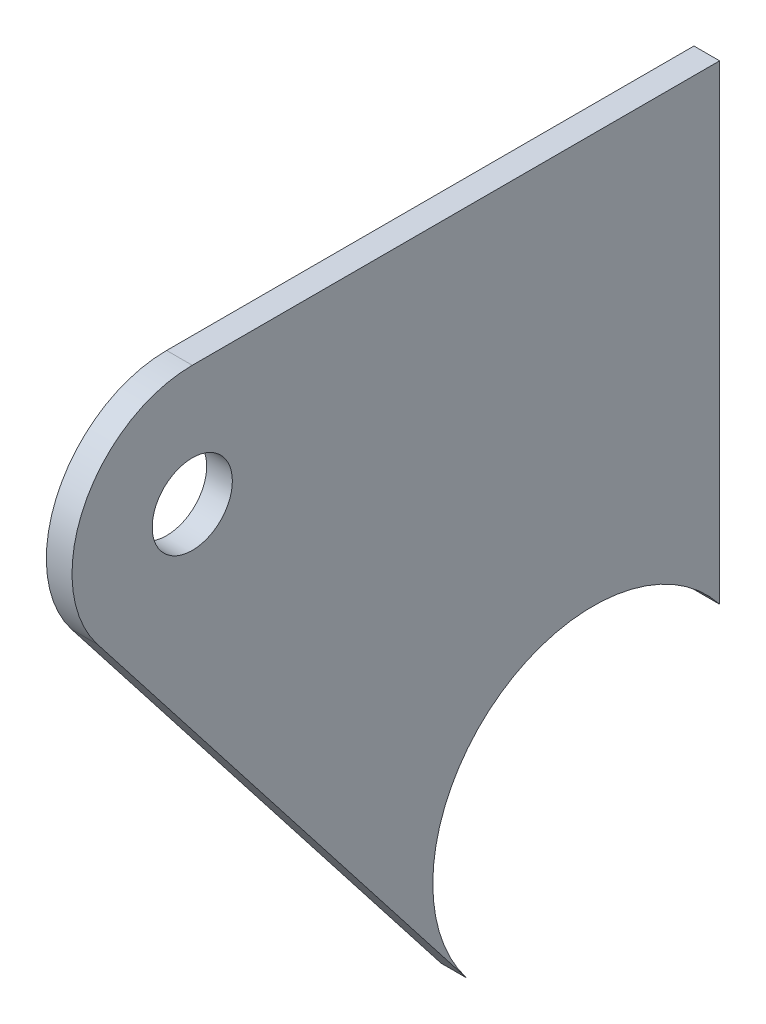
ISO-10303-21;
HEADER;
FILE_DESCRIPTION(('STEP AP214'),'2;1');
FILE_NAME('part.step','',(''),(''),'','','');
FILE_SCHEMA(('AUTOMOTIVE_DESIGN { 1 0 10303 214 1 1 1 1 }'));
ENDSEC;
DATA;
#1=APPLICATION_CONTEXT('core data for automotive mechanical design processes');
#2=APPLICATION_PROTOCOL_DEFINITION('international standard','automotive_design',2000,#1);
#3=PRODUCT_CONTEXT('',#1,'mechanical');
#4=PRODUCT('Part','Part','',(#3));
#5=PRODUCT_RELATED_PRODUCT_CATEGORY('part','',(#4));
#6=PRODUCT_DEFINITION_FORMATION('','',#4);
#7=PRODUCT_DEFINITION_CONTEXT('part definition',#1,'design');
#8=PRODUCT_DEFINITION('design','',#6,#7);
#9=PRODUCT_DEFINITION_SHAPE('','',#8);
#10=(LENGTH_UNIT() NAMED_UNIT(*) SI_UNIT(.MILLI.,.METRE.));
#11=(NAMED_UNIT(*) PLANE_ANGLE_UNIT() SI_UNIT($,.RADIAN.));
#12=(NAMED_UNIT(*) SI_UNIT($,.STERADIAN.) SOLID_ANGLE_UNIT());
#13=UNCERTAINTY_MEASURE_WITH_UNIT(LENGTH_MEASURE(1.E-05),#10,'distance_accuracy_value','');
#14=(GEOMETRIC_REPRESENTATION_CONTEXT(3) GLOBAL_UNCERTAINTY_ASSIGNED_CONTEXT((#13)) GLOBAL_UNIT_ASSIGNED_CONTEXT((#10,
#11,#12)) REPRESENTATION_CONTEXT('',''));
#15=CARTESIAN_POINT('',(0.,0.,0.));
#16=DIRECTION('',(0.,0.,1.));
#17=DIRECTION('',(1.,0.,0.));
#18=AXIS2_PLACEMENT_3D('',#15,#16,#17);
#19=CARTESIAN_POINT('',(14.732,0.,0.));
#20=DIRECTION('',(1.,0.,0.));
#21=DIRECTION('',(0.,0.,-1.));
#22=AXIS2_PLACEMENT_3D('',#19,#20,#21);
#23=PLANE('',#22);
#24=CARTESIAN_POINT('',(14.732,0.,0.));
#25=DIRECTION('',(-1.,0.,0.));
#26=DIRECTION('',(0.,0.,-1.));
#27=AXIS2_PLACEMENT_3D('',#24,#25,#26);
#28=CIRCLE('',#27,12.7);
#29=CARTESIAN_POINT('',(14.732,-7.80867572929975,10.0157168168157));
#30=VERTEX_POINT('',#29);
#31=CARTESIAN_POINT('',(14.732,7.80867572929975,-10.0157168168157));
#32=VERTEX_POINT('',#31);
#33=EDGE_CURVE('E125',#30,#32,#28,.T.);
#34=ORIENTED_EDGE('',*,*,#33,.T.);
#35=DIRECTION('',(0.,1.,0.));
#36=VECTOR('',#35,1.);
#37=CARTESIAN_POINT('',(14.732,45.085,-10.0157168168157));
#38=LINE('',#37,#36);
#39=CARTESIAN_POINT('',(14.732,45.085,-10.0157168168157));
#40=VERTEX_POINT('',#39);
#41=EDGE_CURVE('E92',#32,#40,#38,.T.);
#42=ORIENTED_EDGE('',*,*,#41,.T.);
#43=DIRECTION('',(0.,0.,1.));
#44=VECTOR('',#43,1.);
#45=CARTESIAN_POINT('',(14.732,45.085,31.75));
#46=LINE('',#45,#44);
#47=CARTESIAN_POINT('',(14.732,45.085,31.75));
#48=VERTEX_POINT('',#47);
#49=EDGE_CURVE('E96',#40,#48,#46,.T.);
#50=ORIENTED_EDGE('',*,*,#49,.T.);
#51=CARTESIAN_POINT('',(14.732,35.56,31.75));
#52=DIRECTION('',(1.,0.,0.));
#53=DIRECTION('',(0.,0.,1.));
#54=AXIS2_PLACEMENT_3D('',#51,#52,#53);
#55=CIRCLE('',#54,9.525);
#56=CARTESIAN_POINT('',(14.732,29.7034932030252,39.2617876126118));
#57=VERTEX_POINT('',#56);
#58=EDGE_CURVE('E100',#48,#57,#55,.T.);
#59=ORIENTED_EDGE('',*,*,#58,.T.);
#60=DIRECTION('',(0.,-0.788639119434308,-0.614856356637775));
#61=VECTOR('',#60,1.);
#62=CARTESIAN_POINT('',(14.732,-7.80867572929975,10.0157168168157));
#63=LINE('',#62,#61);
#64=EDGE_CURVE('E58',#57,#30,#63,.T.);
#65=ORIENTED_EDGE('',*,*,#64,.T.);
#66=EDGE_LOOP('',(#34,#42,#50,#59,#65));
#67=FACE_BOUND('',#66,.T.);
#68=CARTESIAN_POINT('',(14.732,35.56,31.75));
#69=DIRECTION('',(1.,0.,0.));
#70=DIRECTION('',(0.,0.,-1.));
#71=AXIS2_PLACEMENT_3D('',#68,#69,#70);
#72=CIRCLE('',#71,3.175);
#73=CARTESIAN_POINT('',(14.732,35.56,28.575));
#74=VERTEX_POINT('',#73);
#75=EDGE_CURVE('E120',#74,#74,#72,.T.);
#76=ORIENTED_EDGE('',*,*,#75,.F.);
#77=EDGE_LOOP('',(#76));
#78=FACE_BOUND('',#77,.T.);
#79=ADVANCED_FACE('F41',(#67,#78),#23,.T.);
#80=CARTESIAN_POINT('',(12.7,0.,0.));
#81=DIRECTION('',(1.,0.,0.));
#82=DIRECTION('',(0.,0.,-1.));
#83=AXIS2_PLACEMENT_3D('',#80,#81,#82);
#84=PLANE('',#83);
#85=CARTESIAN_POINT('',(12.7,0.,0.));
#86=DIRECTION('',(-1.,0.,0.));
#87=DIRECTION('',(0.,0.,-1.));
#88=AXIS2_PLACEMENT_3D('',#85,#86,#87);
#89=CIRCLE('',#88,12.7);
#90=CARTESIAN_POINT('',(12.7,-7.80867572929975,10.0157168168157));
#91=VERTEX_POINT('',#90);
#92=CARTESIAN_POINT('',(12.7,7.80867572929975,-10.0157168168157));
#93=VERTEX_POINT('',#92);
#94=EDGE_CURVE('E116',#91,#93,#89,.T.);
#95=ORIENTED_EDGE('',*,*,#94,.F.);
#96=DIRECTION('',(0.,-0.788639119434308,-0.614856356637775));
#97=VECTOR('',#96,1.);
#98=CARTESIAN_POINT('',(12.7,-7.80867572929975,10.0157168168157));
#99=LINE('',#98,#97);
#100=CARTESIAN_POINT('',(12.7,29.7034932030252,39.2617876126118));
#101=VERTEX_POINT('',#100);
#102=EDGE_CURVE('E84',#101,#91,#99,.T.);
#103=ORIENTED_EDGE('',*,*,#102,.F.);
#104=CARTESIAN_POINT('',(12.7,35.56,31.75));
#105=DIRECTION('',(1.,0.,0.));
#106=DIRECTION('',(0.,0.,1.));
#107=AXIS2_PLACEMENT_3D('',#104,#105,#106);
#108=CIRCLE('',#107,9.525);
#109=CARTESIAN_POINT('',(12.7,45.085,31.75));
#110=VERTEX_POINT('',#109);
#111=EDGE_CURVE('E78',#110,#101,#108,.T.);
#112=ORIENTED_EDGE('',*,*,#111,.F.);
#113=DIRECTION('',(0.,0.,1.));
#114=VECTOR('',#113,1.);
#115=CARTESIAN_POINT('',(12.7,45.085,31.75));
#116=LINE('',#115,#114);
#117=CARTESIAN_POINT('',(12.7,45.085,-10.0157168168157));
#118=VERTEX_POINT('',#117);
#119=EDGE_CURVE('E107',#118,#110,#116,.T.);
#120=ORIENTED_EDGE('',*,*,#119,.F.);
#121=DIRECTION('',(0.,1.,0.));
#122=VECTOR('',#121,1.);
#123=CARTESIAN_POINT('',(12.7,45.085,-10.0157168168157));
#124=LINE('',#123,#122);
#125=EDGE_CURVE('E119',#93,#118,#124,.T.);
#126=ORIENTED_EDGE('',*,*,#125,.F.);
#127=EDGE_LOOP('',(#95,#103,#112,#120,#126));
#128=FACE_BOUND('',#127,.T.);
#129=CARTESIAN_POINT('',(12.7,35.56,31.75));
#130=DIRECTION('',(1.,0.,0.));
#131=DIRECTION('',(0.,0.,-1.));
#132=AXIS2_PLACEMENT_3D('',#129,#130,#131);
#133=CIRCLE('',#132,3.175);
#134=CARTESIAN_POINT('',(12.7,35.56,28.575));
#135=VERTEX_POINT('',#134);
#136=EDGE_CURVE('E221',#135,#135,#133,.T.);
#137=ORIENTED_EDGE('',*,*,#136,.T.);
#138=EDGE_LOOP('',(#137));
#139=FACE_BOUND('',#138,.T.);
#140=ADVANCED_FACE('F129',(#128,#139),#84,.F.);
#141=CARTESIAN_POINT('',(14.732,0.,0.));
#142=DIRECTION('',(-1.,0.,0.));
#143=DIRECTION('',(0.,0.,1.));
#144=AXIS2_PLACEMENT_3D('',#141,#142,#143);
#145=CYLINDRICAL_SURFACE('',#144,12.7);
#146=ORIENTED_EDGE('',*,*,#94,.T.);
#147=DIRECTION('',(-1.,0.,0.));
#148=VECTOR('',#147,1.);
#149=CARTESIAN_POINT('',(14.732,7.80867572929975,-10.0157168168157));
#150=LINE('',#149,#148);
#151=EDGE_CURVE('E11',#32,#93,#150,.T.);
#152=ORIENTED_EDGE('',*,*,#151,.F.);
#153=ORIENTED_EDGE('',*,*,#33,.F.);
#154=DIRECTION('',(-1.,0.,0.));
#155=VECTOR('',#154,1.);
#156=CARTESIAN_POINT('',(14.732,-7.80867572929975,10.0157168168157));
#157=LINE('',#156,#155);
#158=EDGE_CURVE('E112',#30,#91,#157,.T.);
#159=ORIENTED_EDGE('',*,*,#158,.T.);
#160=EDGE_LOOP('',(#146,#152,#153,#159));
#161=FACE_BOUND('',#160,.T.);
#162=ADVANCED_FACE('F43',(#161),#145,.F.);
#163=CARTESIAN_POINT('',(14.732,45.085,-10.0157168168157));
#164=DIRECTION('',(0.,0.,1.));
#165=DIRECTION('',(0.,-1.,0.));
#166=AXIS2_PLACEMENT_3D('',#163,#164,#165);
#167=PLANE('',#166);
#168=ORIENTED_EDGE('',*,*,#125,.T.);
#169=DIRECTION('',(-1.,0.,0.));
#170=VECTOR('',#169,1.);
#171=CARTESIAN_POINT('',(14.732,45.085,-10.0157168168157));
#172=LINE('',#171,#170);
#173=EDGE_CURVE('E50',#40,#118,#172,.T.);
#174=ORIENTED_EDGE('',*,*,#173,.F.);
#175=ORIENTED_EDGE('',*,*,#41,.F.);
#176=ORIENTED_EDGE('',*,*,#151,.T.);
#177=EDGE_LOOP('',(#168,#174,#175,#176));
#178=FACE_BOUND('',#177,.T.);
#179=ADVANCED_FACE('F154',(#178),#167,.F.);
#180=CARTESIAN_POINT('',(14.732,45.085,31.75));
#181=DIRECTION('',(0.,-1.,0.));
#182=DIRECTION('',(0.,0.,-1.));
#183=AXIS2_PLACEMENT_3D('',#180,#181,#182);
#184=PLANE('',#183);
#185=ORIENTED_EDGE('',*,*,#119,.T.);
#186=DIRECTION('',(-1.,0.,0.));
#187=VECTOR('',#186,1.);
#188=CARTESIAN_POINT('',(14.732,45.085,31.75));
#189=LINE('',#188,#187);
#190=EDGE_CURVE('E104',#48,#110,#189,.T.);
#191=ORIENTED_EDGE('',*,*,#190,.F.);
#192=ORIENTED_EDGE('',*,*,#49,.F.);
#193=ORIENTED_EDGE('',*,*,#173,.T.);
#194=EDGE_LOOP('',(#185,#191,#192,#193));
#195=FACE_BOUND('',#194,.T.);
#196=ADVANCED_FACE('F105',(#195),#184,.F.);
#197=CARTESIAN_POINT('',(14.732,35.56,31.75));
#198=DIRECTION('',(-1.,0.,0.));
#199=DIRECTION('',(0.,0.,1.));
#200=AXIS2_PLACEMENT_3D('',#197,#198,#199);
#201=CYLINDRICAL_SURFACE('',#200,9.525);
#202=ORIENTED_EDGE('',*,*,#111,.T.);
#203=DIRECTION('',(-1.,0.,0.));
#204=VECTOR('',#203,1.);
#205=CARTESIAN_POINT('',(14.732,29.7034932030252,39.2617876126118));
#206=LINE('',#205,#204);
#207=EDGE_CURVE('E108',#57,#101,#206,.T.);
#208=ORIENTED_EDGE('',*,*,#207,.F.);
#209=ORIENTED_EDGE('',*,*,#58,.F.);
#210=ORIENTED_EDGE('',*,*,#190,.T.);
#211=EDGE_LOOP('',(#202,#208,#209,#210));
#212=FACE_BOUND('',#211,.T.);
#213=ADVANCED_FACE('F110',(#212),#201,.T.);
#214=CARTESIAN_POINT('',(14.732,-7.80867572929975,10.0157168168157));
#215=DIRECTION('',(0.,0.614856356637775,-0.788639119434308));
#216=DIRECTION('',(0.,0.788639119434308,0.614856356637775));
#217=AXIS2_PLACEMENT_3D('',#214,#215,#216);
#218=PLANE('',#217);
#219=ORIENTED_EDGE('',*,*,#102,.T.);
#220=ORIENTED_EDGE('',*,*,#158,.F.);
#221=ORIENTED_EDGE('',*,*,#64,.F.);
#222=ORIENTED_EDGE('',*,*,#207,.T.);
#223=EDGE_LOOP('',(#219,#220,#221,#222));
#224=FACE_BOUND('',#223,.T.);
#225=ADVANCED_FACE('F134',(#224),#218,.F.);
#226=CARTESIAN_POINT('',(14.732,35.56,31.75));
#227=DIRECTION('',(-1.,0.,0.));
#228=DIRECTION('',(0.,0.,1.));
#229=AXIS2_PLACEMENT_3D('',#226,#227,#228);
#230=CYLINDRICAL_SURFACE('',#229,3.175);
#231=ORIENTED_EDGE('',*,*,#75,.T.);
#232=EDGE_LOOP('',(#231));
#233=FACE_BOUND('',#232,.T.);
#234=ORIENTED_EDGE('',*,*,#136,.F.);
#235=EDGE_LOOP('',(#234));
#236=FACE_BOUND('',#235,.T.);
#237=ADVANCED_FACE('F136',(#233,#236),#230,.F.);
#238=CLOSED_SHELL('',(#79,#140,#162,#179,#196,#213,#225,#237));
#239=MANIFOLD_SOLID_BREP('B2',#238);
#240=ADVANCED_BREP_SHAPE_REPRESENTATION('',(#18,#239),#14);
#241=SHAPE_DEFINITION_REPRESENTATION(#9,#240);
ENDSEC;
END-ISO-10303-21;
